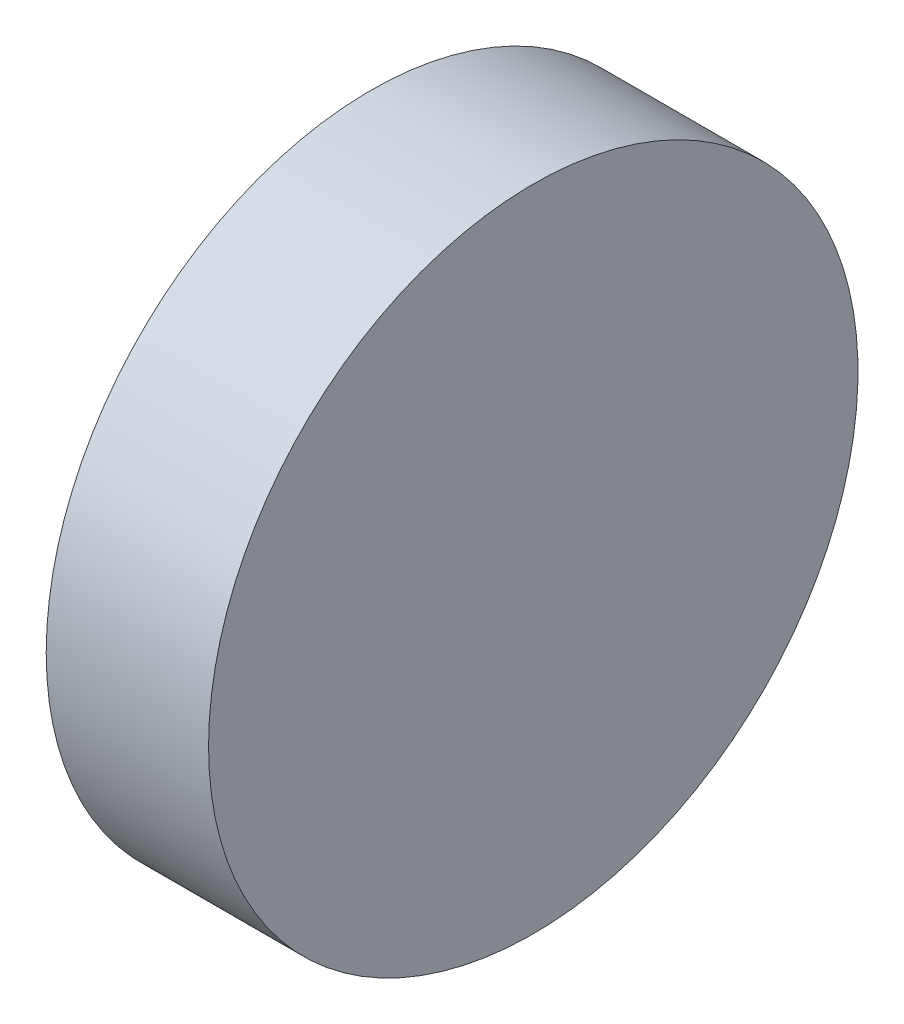
ISO-10303-21;
HEADER;
FILE_DESCRIPTION(('STEP AP214'),'2;1');
FILE_NAME('part.step','',(''),(''),'','','');
FILE_SCHEMA(('AUTOMOTIVE_DESIGN { 1 0 10303 214 1 1 1 1 }'));
ENDSEC;
DATA;
#1=APPLICATION_CONTEXT('core data for automotive mechanical design processes');
#2=APPLICATION_PROTOCOL_DEFINITION('international standard','automotive_design',2000,#1);
#3=PRODUCT_CONTEXT('',#1,'mechanical');
#4=PRODUCT('Part','Part','',(#3));
#5=PRODUCT_RELATED_PRODUCT_CATEGORY('part','',(#4));
#6=PRODUCT_DEFINITION_FORMATION('','',#4);
#7=PRODUCT_DEFINITION_CONTEXT('part definition',#1,'design');
#8=PRODUCT_DEFINITION('design','',#6,#7);
#9=PRODUCT_DEFINITION_SHAPE('','',#8);
#10=(LENGTH_UNIT() NAMED_UNIT(*) SI_UNIT(.MILLI.,.METRE.));
#11=(NAMED_UNIT(*) PLANE_ANGLE_UNIT() SI_UNIT($,.RADIAN.));
#12=(NAMED_UNIT(*) SI_UNIT($,.STERADIAN.) SOLID_ANGLE_UNIT());
#13=UNCERTAINTY_MEASURE_WITH_UNIT(LENGTH_MEASURE(1.E-05),#10,'distance_accuracy_value','');
#14=(GEOMETRIC_REPRESENTATION_CONTEXT(3) GLOBAL_UNCERTAINTY_ASSIGNED_CONTEXT((#13)) GLOBAL_UNIT_ASSIGNED_CONTEXT((#10,
#11,#12)) REPRESENTATION_CONTEXT('',''));
#15=CARTESIAN_POINT('',(0.,0.,0.));
#16=DIRECTION('',(0.,0.,1.));
#17=DIRECTION('',(1.,0.,0.));
#18=AXIS2_PLACEMENT_3D('',#15,#16,#17);
#19=CARTESIAN_POINT('',(519.448705786129,154.586358698031,0.));
#20=DIRECTION('',(1.,0.,0.));
#21=DIRECTION('',(0.,0.,-1.));
#22=AXIS2_PLACEMENT_3D('',#19,#20,#21);
#23=PLANE('',#22);
#24=CARTESIAN_POINT('',(519.448705786129,154.586358698031,0.));
#25=DIRECTION('',(-1.,0.,0.));
#26=DIRECTION('',(0.,0.,1.));
#27=AXIS2_PLACEMENT_3D('',#24,#25,#26);
#28=CIRCLE('',#27,25.4);
#29=CARTESIAN_POINT('',(519.448705786129,154.586358698031,25.4));
#30=VERTEX_POINT('',#29);
#31=EDGE_CURVE('E10',#30,#30,#28,.T.);
#32=ORIENTED_EDGE('',*,*,#31,.T.);
#33=EDGE_LOOP('',(#32));
#34=FACE_BOUND('',#33,.T.);
#35=ADVANCED_FACE('F35',(#34),#23,.F.);
#36=CARTESIAN_POINT('',(508.001603985232,154.586358698031,0.));
#37=DIRECTION('',(-1.,0.,0.));
#38=DIRECTION('',(0.,0.,1.));
#39=AXIS2_PLACEMENT_3D('',#36,#37,#38);
#40=CYLINDRICAL_SURFACE('',#39,25.4);
#41=ORIENTED_EDGE('',*,*,#31,.F.);
#42=EDGE_LOOP('',(#41));
#43=FACE_BOUND('',#42,.T.);
#44=CARTESIAN_POINT('',(532.148705786129,154.586358698031,0.));
#45=DIRECTION('',(-1.,0.,0.));
#46=DIRECTION('',(0.,0.,1.));
#47=AXIS2_PLACEMENT_3D('',#44,#45,#46);
#48=CIRCLE('',#47,25.4);
#49=CARTESIAN_POINT('',(532.148705786129,154.586358698031,25.4));
#50=VERTEX_POINT('',#49);
#51=EDGE_CURVE('E41',#50,#50,#48,.T.);
#52=ORIENTED_EDGE('',*,*,#51,.T.);
#53=EDGE_LOOP('',(#52));
#54=FACE_BOUND('',#53,.T.);
#55=ADVANCED_FACE('F47',(#43,#54),#40,.T.);
#56=CARTESIAN_POINT('',(532.148705786129,154.586358698031,0.));
#57=DIRECTION('',(-1.,0.,0.));
#58=DIRECTION('',(0.,0.,1.));
#59=AXIS2_PLACEMENT_3D('',#56,#57,#58);
#60=PLANE('',#59);
#61=ORIENTED_EDGE('',*,*,#51,.F.);
#62=EDGE_LOOP('',(#61));
#63=FACE_BOUND('',#62,.T.);
#64=ADVANCED_FACE('F49',(#63),#60,.F.);
#65=CLOSED_SHELL('',(#35,#55,#64));
#66=MANIFOLD_SOLID_BREP('B2',#65);
#67=ADVANCED_BREP_SHAPE_REPRESENTATION('',(#18,#66),#14);
#68=SHAPE_DEFINITION_REPRESENTATION(#9,#67);
ENDSEC;
END-ISO-10303-21;
